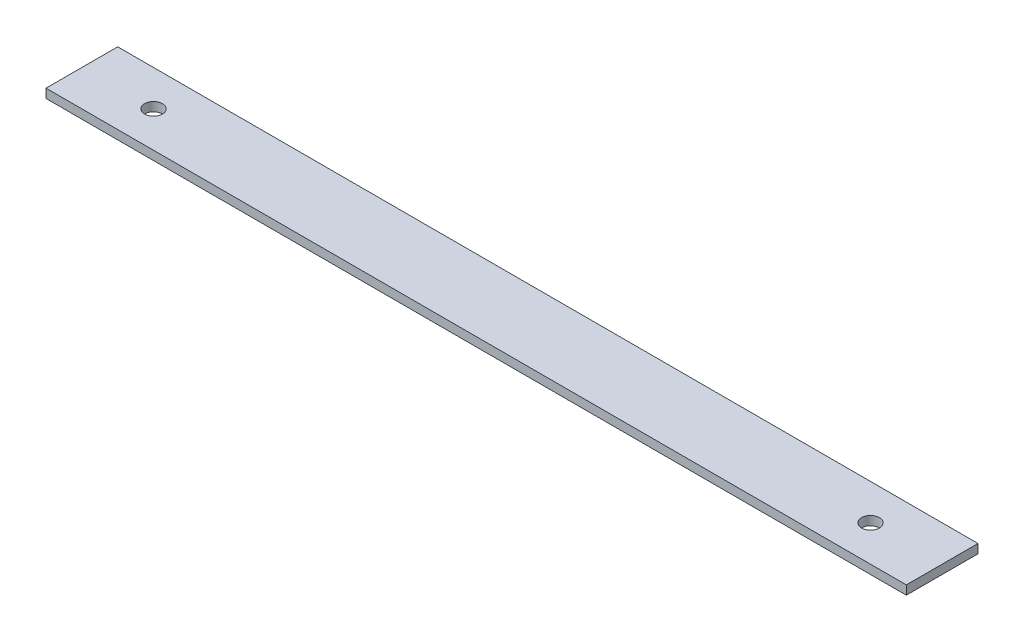
ISO-10303-21;
HEADER;
FILE_DESCRIPTION(('STEP AP214'),'2;1');
FILE_NAME('part.step','',(''),(''),'','','');
FILE_SCHEMA(('AUTOMOTIVE_DESIGN { 1 0 10303 214 1 1 1 1 }'));
ENDSEC;
DATA;
#1=APPLICATION_CONTEXT('core data for automotive mechanical design processes');
#2=APPLICATION_PROTOCOL_DEFINITION('international standard','automotive_design',2000,#1);
#3=PRODUCT_CONTEXT('',#1,'mechanical');
#4=PRODUCT('Part','Part','',(#3));
#5=PRODUCT_RELATED_PRODUCT_CATEGORY('part','',(#4));
#6=PRODUCT_DEFINITION_FORMATION('','',#4);
#7=PRODUCT_DEFINITION_CONTEXT('part definition',#1,'design');
#8=PRODUCT_DEFINITION('design','',#6,#7);
#9=PRODUCT_DEFINITION_SHAPE('','',#8);
#10=(LENGTH_UNIT() NAMED_UNIT(*) SI_UNIT(.MILLI.,.METRE.));
#11=(NAMED_UNIT(*) PLANE_ANGLE_UNIT() SI_UNIT($,.RADIAN.));
#12=(NAMED_UNIT(*) SI_UNIT($,.STERADIAN.) SOLID_ANGLE_UNIT());
#13=UNCERTAINTY_MEASURE_WITH_UNIT(LENGTH_MEASURE(1.E-05),#10,'distance_accuracy_value','');
#14=(GEOMETRIC_REPRESENTATION_CONTEXT(3) GLOBAL_UNCERTAINTY_ASSIGNED_CONTEXT((#13)) GLOBAL_UNIT_ASSIGNED_CONTEXT((#10,
#11,#12)) REPRESENTATION_CONTEXT('',''));
#15=CARTESIAN_POINT('',(0.,0.,0.));
#16=DIRECTION('',(0.,0.,1.));
#17=DIRECTION('',(1.,0.,0.));
#18=AXIS2_PLACEMENT_3D('',#15,#16,#17);
#19=CARTESIAN_POINT('',(0.,3.175,0.));
#20=DIRECTION('',(1.,0.,0.));
#21=DIRECTION('',(0.,0.,-1.));
#22=AXIS2_PLACEMENT_3D('',#19,#20,#21);
#23=PLANE('',#22);
#24=DIRECTION('',(0.,0.,1.));
#25=VECTOR('',#24,1.);
#26=CARTESIAN_POINT('',(0.,0.,0.));
#27=LINE('',#26,#25);
#28=CARTESIAN_POINT('',(0.,0.,-25.4));
#29=VERTEX_POINT('',#28);
#30=CARTESIAN_POINT('',(0.,0.,0.));
#31=VERTEX_POINT('',#30);
#32=EDGE_CURVE('E116',#29,#31,#27,.T.);
#33=ORIENTED_EDGE('',*,*,#32,.T.);
#34=DIRECTION('',(0.,-1.,0.));
#35=VECTOR('',#34,1.);
#36=CARTESIAN_POINT('',(0.,3.175,0.));
#37=LINE('',#36,#35);
#38=CARTESIAN_POINT('',(0.,3.175,0.));
#39=VERTEX_POINT('',#38);
#40=EDGE_CURVE('E11',#39,#31,#37,.T.);
#41=ORIENTED_EDGE('',*,*,#40,.F.);
#42=DIRECTION('',(0.,0.,1.));
#43=VECTOR('',#42,1.);
#44=CARTESIAN_POINT('',(0.,3.175,0.));
#45=LINE('',#44,#43);
#46=CARTESIAN_POINT('',(0.,3.175,-25.4));
#47=VERTEX_POINT('',#46);
#48=EDGE_CURVE('E99',#47,#39,#45,.T.);
#49=ORIENTED_EDGE('',*,*,#48,.F.);
#50=DIRECTION('',(0.,-1.,0.));
#51=VECTOR('',#50,1.);
#52=CARTESIAN_POINT('',(0.,3.175,-25.4));
#53=LINE('',#52,#51);
#54=EDGE_CURVE('E112',#47,#29,#53,.T.);
#55=ORIENTED_EDGE('',*,*,#54,.T.);
#56=EDGE_LOOP('',(#33,#41,#49,#55));
#57=FACE_BOUND('',#56,.T.);
#58=ADVANCED_FACE('F39',(#57),#23,.F.);
#59=CARTESIAN_POINT('',(0.,3.175,0.));
#60=DIRECTION('',(0.,0.,-1.));
#61=DIRECTION('',(-1.,0.,0.));
#62=AXIS2_PLACEMENT_3D('',#59,#60,#61);
#63=PLANE('',#62);
#64=DIRECTION('',(1.,0.,0.));
#65=VECTOR('',#64,1.);
#66=CARTESIAN_POINT('',(0.,0.,0.));
#67=LINE('',#66,#65);
#68=CARTESIAN_POINT('',(304.8,0.,0.));
#69=VERTEX_POINT('',#68);
#70=EDGE_CURVE('E104',#31,#69,#67,.T.);
#71=ORIENTED_EDGE('',*,*,#70,.T.);
#72=DIRECTION('',(0.,-1.,0.));
#73=VECTOR('',#72,1.);
#74=CARTESIAN_POINT('',(304.8,3.175,0.));
#75=LINE('',#74,#73);
#76=CARTESIAN_POINT('',(304.8,3.175,0.));
#77=VERTEX_POINT('',#76);
#78=EDGE_CURVE('E48',#77,#69,#75,.T.);
#79=ORIENTED_EDGE('',*,*,#78,.F.);
#80=DIRECTION('',(1.,0.,0.));
#81=VECTOR('',#80,1.);
#82=CARTESIAN_POINT('',(0.,3.175,0.));
#83=LINE('',#82,#81);
#84=EDGE_CURVE('E93',#39,#77,#83,.T.);
#85=ORIENTED_EDGE('',*,*,#84,.F.);
#86=ORIENTED_EDGE('',*,*,#40,.T.);
#87=EDGE_LOOP('',(#71,#79,#85,#86));
#88=FACE_BOUND('',#87,.T.);
#89=ADVANCED_FACE('F103',(#88),#63,.F.);
#90=CARTESIAN_POINT('',(304.8,3.175,0.));
#91=DIRECTION('',(-1.,0.,0.));
#92=DIRECTION('',(0.,0.,1.));
#93=AXIS2_PLACEMENT_3D('',#90,#91,#92);
#94=PLANE('',#93);
#95=DIRECTION('',(0.,0.,-1.));
#96=VECTOR('',#95,1.);
#97=CARTESIAN_POINT('',(304.8,0.,0.));
#98=LINE('',#97,#96);
#99=CARTESIAN_POINT('',(304.8,0.,-25.4));
#100=VERTEX_POINT('',#99);
#101=EDGE_CURVE('E80',#69,#100,#98,.T.);
#102=ORIENTED_EDGE('',*,*,#101,.T.);
#103=DIRECTION('',(0.,-1.,0.));
#104=VECTOR('',#103,1.);
#105=CARTESIAN_POINT('',(304.8,3.175,-25.4));
#106=LINE('',#105,#104);
#107=CARTESIAN_POINT('',(304.8,3.175,-25.4));
#108=VERTEX_POINT('',#107);
#109=EDGE_CURVE('E106',#108,#100,#106,.T.);
#110=ORIENTED_EDGE('',*,*,#109,.F.);
#111=DIRECTION('',(0.,0.,-1.));
#112=VECTOR('',#111,1.);
#113=CARTESIAN_POINT('',(304.8,3.175,0.));
#114=LINE('',#113,#112);
#115=EDGE_CURVE('E97',#77,#108,#114,.T.);
#116=ORIENTED_EDGE('',*,*,#115,.F.);
#117=ORIENTED_EDGE('',*,*,#78,.T.);
#118=EDGE_LOOP('',(#102,#110,#116,#117));
#119=FACE_BOUND('',#118,.T.);
#120=ADVANCED_FACE('F107',(#119),#94,.F.);
#121=CARTESIAN_POINT('',(0.,3.175,-25.4));
#122=DIRECTION('',(0.,0.,1.));
#123=DIRECTION('',(1.,0.,0.));
#124=AXIS2_PLACEMENT_3D('',#121,#122,#123);
#125=PLANE('',#124);
#126=DIRECTION('',(-1.,0.,0.));
#127=VECTOR('',#126,1.);
#128=CARTESIAN_POINT('',(0.,0.,-25.4));
#129=LINE('',#128,#127);
#130=EDGE_CURVE('E86',#100,#29,#129,.T.);
#131=ORIENTED_EDGE('',*,*,#130,.T.);
#132=ORIENTED_EDGE('',*,*,#54,.F.);
#133=DIRECTION('',(-1.,0.,0.));
#134=VECTOR('',#133,1.);
#135=CARTESIAN_POINT('',(0.,3.175,-25.4));
#136=LINE('',#135,#134);
#137=EDGE_CURVE('E59',#108,#47,#136,.T.);
#138=ORIENTED_EDGE('',*,*,#137,.F.);
#139=ORIENTED_EDGE('',*,*,#109,.T.);
#140=EDGE_LOOP('',(#131,#132,#138,#139));
#141=FACE_BOUND('',#140,.T.);
#142=ADVANCED_FACE('F129',(#141),#125,.F.);
#143=CARTESIAN_POINT('',(0.,3.175,0.));
#144=DIRECTION('',(0.,-1.,0.));
#145=DIRECTION('',(0.,0.,-1.));
#146=AXIS2_PLACEMENT_3D('',#143,#144,#145);
#147=PLANE('',#146);
#148=CARTESIAN_POINT('',(279.4,3.175,-12.7));
#149=DIRECTION('',(0.,1.,0.));
#150=DIRECTION('',(0.,0.,1.));
#151=AXIS2_PLACEMENT_3D('',#148,#149,#150);
#152=CIRCLE('',#151,3.17499999999997);
#153=CARTESIAN_POINT('',(279.4,3.175,-9.52500000000003));
#154=VERTEX_POINT('',#153);
#155=EDGE_CURVE('E144',#154,#154,#152,.T.);
#156=ORIENTED_EDGE('',*,*,#155,.F.);
#157=EDGE_LOOP('',(#156));
#158=FACE_BOUND('',#157,.T.);
#159=CARTESIAN_POINT('',(25.4,3.175,-12.7));
#160=DIRECTION('',(0.,1.,0.));
#161=DIRECTION('',(0.,0.,1.));
#162=AXIS2_PLACEMENT_3D('',#159,#160,#161);
#163=CIRCLE('',#162,3.175);
#164=CARTESIAN_POINT('',(25.4,3.175,-9.525));
#165=VERTEX_POINT('',#164);
#166=EDGE_CURVE('E136',#165,#165,#163,.T.);
#167=ORIENTED_EDGE('',*,*,#166,.F.);
#168=EDGE_LOOP('',(#167));
#169=FACE_BOUND('',#168,.T.);
#170=ORIENTED_EDGE('',*,*,#48,.T.);
#171=ORIENTED_EDGE('',*,*,#84,.T.);
#172=ORIENTED_EDGE('',*,*,#115,.T.);
#173=ORIENTED_EDGE('',*,*,#137,.T.);
#174=EDGE_LOOP('',(#170,#171,#172,#173));
#175=FACE_BOUND('',#174,.T.);
#176=ADVANCED_FACE('F95',(#158,#169,#175),#147,.F.);
#177=CARTESIAN_POINT('',(0.,0.,0.));
#178=DIRECTION('',(0.,-1.,0.));
#179=DIRECTION('',(0.,0.,-1.));
#180=AXIS2_PLACEMENT_3D('',#177,#178,#179);
#181=PLANE('',#180);
#182=CARTESIAN_POINT('',(279.4,0.,-12.7));
#183=DIRECTION('',(0.,1.,0.));
#184=DIRECTION('',(0.,0.,1.));
#185=AXIS2_PLACEMENT_3D('',#182,#183,#184);
#186=CIRCLE('',#185,3.17499999999997);
#187=CARTESIAN_POINT('',(279.4,0.,-9.52500000000003));
#188=VERTEX_POINT('',#187);
#189=EDGE_CURVE('E120',#188,#188,#186,.T.);
#190=ORIENTED_EDGE('',*,*,#189,.T.);
#191=EDGE_LOOP('',(#190));
#192=FACE_BOUND('',#191,.T.);
#193=CARTESIAN_POINT('',(25.4,0.,-12.7));
#194=DIRECTION('',(0.,1.,0.));
#195=DIRECTION('',(0.,0.,1.));
#196=AXIS2_PLACEMENT_3D('',#193,#194,#195);
#197=CIRCLE('',#196,3.175);
#198=CARTESIAN_POINT('',(25.4,0.,-9.525));
#199=VERTEX_POINT('',#198);
#200=EDGE_CURVE('E140',#199,#199,#197,.T.);
#201=ORIENTED_EDGE('',*,*,#200,.T.);
#202=EDGE_LOOP('',(#201));
#203=FACE_BOUND('',#202,.T.);
#204=ORIENTED_EDGE('',*,*,#32,.F.);
#205=ORIENTED_EDGE('',*,*,#130,.F.);
#206=ORIENTED_EDGE('',*,*,#101,.F.);
#207=ORIENTED_EDGE('',*,*,#70,.F.);
#208=EDGE_LOOP('',(#204,#205,#206,#207));
#209=FACE_BOUND('',#208,.T.);
#210=ADVANCED_FACE('F132',(#192,#203,#209),#181,.T.);
#211=CARTESIAN_POINT('',(25.4,0.,-12.7));
#212=DIRECTION('',(0.,1.,0.));
#213=DIRECTION('',(0.,0.,1.));
#214=AXIS2_PLACEMENT_3D('',#211,#212,#213);
#215=CYLINDRICAL_SURFACE('',#214,3.175);
#216=ORIENTED_EDGE('',*,*,#200,.F.);
#217=EDGE_LOOP('',(#216));
#218=FACE_BOUND('',#217,.T.);
#219=ORIENTED_EDGE('',*,*,#166,.T.);
#220=EDGE_LOOP('',(#219));
#221=FACE_BOUND('',#220,.T.);
#222=ADVANCED_FACE('F157',(#218,#221),#215,.F.);
#223=CARTESIAN_POINT('',(279.4,0.,-12.7));
#224=DIRECTION('',(0.,1.,0.));
#225=DIRECTION('',(0.,0.,1.));
#226=AXIS2_PLACEMENT_3D('',#223,#224,#225);
#227=CYLINDRICAL_SURFACE('',#226,3.17499999999997);
#228=ORIENTED_EDGE('',*,*,#189,.F.);
#229=EDGE_LOOP('',(#228));
#230=FACE_BOUND('',#229,.T.);
#231=ORIENTED_EDGE('',*,*,#155,.T.);
#232=EDGE_LOOP('',(#231));
#233=FACE_BOUND('',#232,.T.);
#234=ADVANCED_FACE('F154',(#230,#233),#227,.F.);
#235=CLOSED_SHELL('',(#58,#89,#120,#142,#176,#210,#222,#234));
#236=MANIFOLD_SOLID_BREP('B2',#235);
#237=ADVANCED_BREP_SHAPE_REPRESENTATION('',(#18,#236),#14);
#238=SHAPE_DEFINITION_REPRESENTATION(#9,#237);
ENDSEC;
END-ISO-10303-21;
